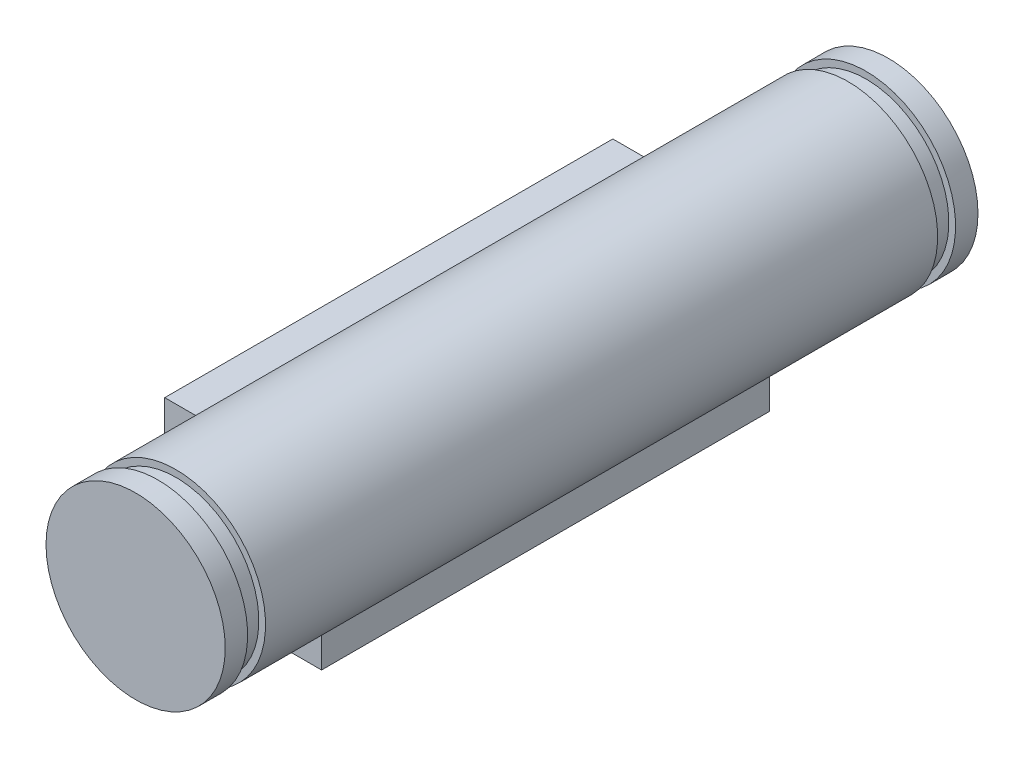
ISO-10303-21;
HEADER;
FILE_DESCRIPTION(('STEP AP214'),'2;1');
FILE_NAME('part.step','',(''),(''),'','','');
FILE_SCHEMA(('AUTOMOTIVE_DESIGN { 1 0 10303 214 1 1 1 1 }'));
ENDSEC;
DATA;
#1=APPLICATION_CONTEXT('core data for automotive mechanical design processes');
#2=APPLICATION_PROTOCOL_DEFINITION('international standard','automotive_design',2000,#1);
#3=PRODUCT_CONTEXT('',#1,'mechanical');
#4=PRODUCT('Part','Part','',(#3));
#5=PRODUCT_RELATED_PRODUCT_CATEGORY('part','',(#4));
#6=PRODUCT_DEFINITION_FORMATION('','',#4);
#7=PRODUCT_DEFINITION_CONTEXT('part definition',#1,'design');
#8=PRODUCT_DEFINITION('design','',#6,#7);
#9=PRODUCT_DEFINITION_SHAPE('','',#8);
#10=(LENGTH_UNIT() NAMED_UNIT(*) SI_UNIT(.MILLI.,.METRE.));
#11=(NAMED_UNIT(*) PLANE_ANGLE_UNIT() SI_UNIT($,.RADIAN.));
#12=(NAMED_UNIT(*) SI_UNIT($,.STERADIAN.) SOLID_ANGLE_UNIT());
#13=UNCERTAINTY_MEASURE_WITH_UNIT(LENGTH_MEASURE(1.E-05),#10,'distance_accuracy_value','');
#14=(GEOMETRIC_REPRESENTATION_CONTEXT(3) GLOBAL_UNCERTAINTY_ASSIGNED_CONTEXT((#13)) GLOBAL_UNIT_ASSIGNED_CONTEXT((#10,
#11,#12)) REPRESENTATION_CONTEXT('',''));
#15=CARTESIAN_POINT('',(0.,0.,0.));
#16=DIRECTION('',(0.,0.,1.));
#17=DIRECTION('',(1.,0.,0.));
#18=AXIS2_PLACEMENT_3D('',#15,#16,#17);
#19=CARTESIAN_POINT('',(0.,0.,16.8));
#20=DIRECTION('',(0.,0.,-1.));
#21=DIRECTION('',(-1.,0.,0.));
#22=AXIS2_PLACEMENT_3D('',#19,#20,#21);
#23=CYLINDRICAL_SURFACE('',#22,4.);
#24=DIRECTION('',(0.,0.,-1.));
#25=VECTOR('',#24,1.);
#26=CARTESIAN_POINT('',(-1.52999999999999,-3.69582196540905,10.));
#27=LINE('',#26,#25);
#28=CARTESIAN_POINT('',(-1.52999999999999,-3.69582196540905,10.));
#29=VERTEX_POINT('',#28);
#30=CARTESIAN_POINT('',(-1.52999999999999,-3.69582196540905,-10.));
#31=VERTEX_POINT('',#30);
#32=EDGE_CURVE('E60',#29,#31,#27,.T.);
#33=ORIENTED_EDGE('',*,*,#32,.F.);
#34=CARTESIAN_POINT('',(0.,0.,10.));
#35=DIRECTION('',(0.,0.,1.));
#36=DIRECTION('',(1.,0.,0.));
#37=AXIS2_PLACEMENT_3D('',#34,#35,#36);
#38=CIRCLE('',#37,4.);
#39=CARTESIAN_POINT('',(1.50000000000001,-3.70809924354783,10.));
#40=VERTEX_POINT('',#39);
#41=EDGE_CURVE('E45',#29,#40,#38,.T.);
#42=ORIENTED_EDGE('',*,*,#41,.T.);
#43=DIRECTION('',(0.,0.,-1.));
#44=VECTOR('',#43,1.);
#45=CARTESIAN_POINT('',(1.50000000000001,-3.70809924354783,10.));
#46=LINE('',#45,#44);
#47=CARTESIAN_POINT('',(1.50000000000001,-3.70809924354783,-10.));
#48=VERTEX_POINT('',#47);
#49=EDGE_CURVE('E172',#40,#48,#46,.T.);
#50=ORIENTED_EDGE('',*,*,#49,.T.);
#51=CARTESIAN_POINT('',(0.,0.,-10.));
#52=DIRECTION('',(0.,0.,1.));
#53=DIRECTION('',(1.,0.,0.));
#54=AXIS2_PLACEMENT_3D('',#51,#52,#53);
#55=CIRCLE('',#54,4.);
#56=EDGE_CURVE('E209',#31,#48,#55,.T.);
#57=ORIENTED_EDGE('',*,*,#56,.F.);
#58=EDGE_LOOP('',(#33,#42,#50,#57));
#59=FACE_BOUND('',#58,.T.);
#60=CARTESIAN_POINT('',(-3.69582196540905,1.53,10.));
#61=VERTEX_POINT('',#60);
#62=CARTESIAN_POINT('',(-3.70809924354783,-1.5,10.));
#63=VERTEX_POINT('',#62);
#64=EDGE_CURVE('E11',#61,#63,#38,.T.);
#65=ORIENTED_EDGE('',*,*,#64,.T.);
#66=DIRECTION('',(0.,0.,-1.));
#67=VECTOR('',#66,1.);
#68=CARTESIAN_POINT('',(-3.70809924354783,-1.5,10.));
#69=LINE('',#68,#67);
#70=CARTESIAN_POINT('',(-3.70809924354783,-1.5,-10.));
#71=VERTEX_POINT('',#70);
#72=EDGE_CURVE('E149',#63,#71,#69,.T.);
#73=ORIENTED_EDGE('',*,*,#72,.T.);
#74=CARTESIAN_POINT('',(-3.69582196540905,1.53,-10.));
#75=VERTEX_POINT('',#74);
#76=EDGE_CURVE('E211',#75,#71,#55,.T.);
#77=ORIENTED_EDGE('',*,*,#76,.F.);
#78=DIRECTION('',(0.,0.,-1.));
#79=VECTOR('',#78,1.);
#80=CARTESIAN_POINT('',(-3.69582196540905,1.53,10.));
#81=LINE('',#80,#79);
#82=EDGE_CURVE('E169',#61,#75,#81,.T.);
#83=ORIENTED_EDGE('',*,*,#82,.F.);
#84=EDGE_LOOP('',(#65,#73,#77,#83));
#85=FACE_BOUND('',#84,.T.);
#86=CARTESIAN_POINT('',(0.,0.,15.));
#87=DIRECTION('',(0.,0.,-1.));
#88=DIRECTION('',(-1.,0.,0.));
#89=AXIS2_PLACEMENT_3D('',#86,#87,#88);
#90=CIRCLE('',#89,4.);
#91=CARTESIAN_POINT('',(-4.,0.,15.));
#92=VERTEX_POINT('',#91);
#93=EDGE_CURVE('E193',#92,#92,#90,.T.);
#94=ORIENTED_EDGE('',*,*,#93,.T.);
#95=EDGE_LOOP('',(#94));
#96=FACE_BOUND('',#95,.T.);
#97=CARTESIAN_POINT('',(0.,0.,-15.));
#98=DIRECTION('',(0.,0.,-1.));
#99=DIRECTION('',(-1.,0.,0.));
#100=AXIS2_PLACEMENT_3D('',#97,#98,#99);
#101=CIRCLE('',#100,4.);
#102=CARTESIAN_POINT('',(-4.,0.,-15.));
#103=VERTEX_POINT('',#102);
#104=EDGE_CURVE('E184',#103,#103,#101,.T.);
#105=ORIENTED_EDGE('',*,*,#104,.F.);
#106=EDGE_LOOP('',(#105));
#107=FACE_BOUND('',#106,.T.);
#108=ADVANCED_FACE('F37',(#59,#85,#96,#107),#23,.T.);
#109=CARTESIAN_POINT('',(0.,4.,15.));
#110=DIRECTION('',(0.,0.,-1.));
#111=DIRECTION('',(-1.,0.,0.));
#112=AXIS2_PLACEMENT_3D('',#109,#110,#111);
#113=PLANE('',#112);
#114=ORIENTED_EDGE('',*,*,#93,.F.);
#115=EDGE_LOOP('',(#114));
#116=FACE_BOUND('',#115,.T.);
#117=CARTESIAN_POINT('',(0.,0.,15.));
#118=DIRECTION('',(0.,0.,-1.));
#119=DIRECTION('',(-1.,0.,0.));
#120=AXIS2_PLACEMENT_3D('',#117,#118,#119);
#121=CIRCLE('',#120,3.7);
#122=CARTESIAN_POINT('',(-3.7,0.,15.));
#123=VERTEX_POINT('',#122);
#124=EDGE_CURVE('E202',#123,#123,#121,.T.);
#125=ORIENTED_EDGE('',*,*,#124,.T.);
#126=EDGE_LOOP('',(#125));
#127=FACE_BOUND('',#126,.T.);
#128=ADVANCED_FACE('F238',(#116,#127),#113,.F.);
#129=CARTESIAN_POINT('',(0.,0.,-18.8));
#130=DIRECTION('',(0.,0.,-1.));
#131=DIRECTION('',(-1.,0.,0.));
#132=AXIS2_PLACEMENT_3D('',#129,#130,#131);
#133=CYLINDRICAL_SURFACE('',#132,3.7);
#134=ORIENTED_EDGE('',*,*,#124,.F.);
#135=EDGE_LOOP('',(#134));
#136=FACE_BOUND('',#135,.T.);
#137=CARTESIAN_POINT('',(0.,0.,15.8));
#138=DIRECTION('',(0.,0.,-1.));
#139=DIRECTION('',(-1.,0.,0.));
#140=AXIS2_PLACEMENT_3D('',#137,#138,#139);
#141=CIRCLE('',#140,3.7);
#142=CARTESIAN_POINT('',(-3.7,0.,15.8));
#143=VERTEX_POINT('',#142);
#144=EDGE_CURVE('E199',#143,#143,#141,.T.);
#145=ORIENTED_EDGE('',*,*,#144,.T.);
#146=EDGE_LOOP('',(#145));
#147=FACE_BOUND('',#146,.T.);
#148=ADVANCED_FACE('F272',(#136,#147),#133,.T.);
#149=CARTESIAN_POINT('',(0.,3.7,15.8));
#150=DIRECTION('',(0.,0.,1.));
#151=DIRECTION('',(1.,0.,0.));
#152=AXIS2_PLACEMENT_3D('',#149,#150,#151);
#153=PLANE('',#152);
#154=ORIENTED_EDGE('',*,*,#144,.F.);
#155=EDGE_LOOP('',(#154));
#156=FACE_BOUND('',#155,.T.);
#157=CARTESIAN_POINT('',(0.,0.,15.8));
#158=DIRECTION('',(0.,0.,-1.));
#159=DIRECTION('',(-1.,0.,0.));
#160=AXIS2_PLACEMENT_3D('',#157,#158,#159);
#161=CIRCLE('',#160,4.);
#162=CARTESIAN_POINT('',(-4.,0.,15.8));
#163=VERTEX_POINT('',#162);
#164=EDGE_CURVE('E196',#163,#163,#161,.T.);
#165=ORIENTED_EDGE('',*,*,#164,.T.);
#166=EDGE_LOOP('',(#165));
#167=FACE_BOUND('',#166,.T.);
#168=ADVANCED_FACE('F268',(#156,#167),#153,.F.);
#169=CARTESIAN_POINT('',(0.,0.,16.8));
#170=DIRECTION('',(0.,0.,1.));
#171=DIRECTION('',(1.,0.,0.));
#172=AXIS2_PLACEMENT_3D('',#169,#170,#171);
#173=PLANE('',#172);
#174=CARTESIAN_POINT('',(0.,0.,16.8));
#175=DIRECTION('',(0.,0.,1.));
#176=DIRECTION('',(1.,0.,0.));
#177=AXIS2_PLACEMENT_3D('',#174,#175,#176);
#178=CIRCLE('',#177,4.);
#179=CARTESIAN_POINT('',(4.,0.,16.8));
#180=VERTEX_POINT('',#179);
#181=EDGE_CURVE('E206',#180,#180,#178,.T.);
#182=ORIENTED_EDGE('',*,*,#181,.T.);
#183=EDGE_LOOP('',(#182));
#184=FACE_BOUND('',#183,.T.);
#185=ADVANCED_FACE('F271',(#184),#173,.T.);
#186=ORIENTED_EDGE('',*,*,#164,.F.);
#187=EDGE_LOOP('',(#186));
#188=FACE_BOUND('',#187,.T.);
#189=ORIENTED_EDGE('',*,*,#181,.F.);
#190=EDGE_LOOP('',(#189));
#191=FACE_BOUND('',#190,.T.);
#192=ADVANCED_FACE('F39',(#188,#191),#23,.T.);
#193=CARTESIAN_POINT('',(0.,0.,-18.8));
#194=DIRECTION('',(0.,0.,-1.));
#195=DIRECTION('',(-1.,0.,0.));
#196=AXIS2_PLACEMENT_3D('',#193,#194,#195);
#197=CYLINDRICAL_SURFACE('',#196,3.7);
#198=CARTESIAN_POINT('',(0.,0.,-15.8));
#199=DIRECTION('',(0.,0.,-1.));
#200=DIRECTION('',(-1.,0.,0.));
#201=AXIS2_PLACEMENT_3D('',#198,#199,#200);
#202=CIRCLE('',#201,3.7);
#203=CARTESIAN_POINT('',(-3.7,0.,-15.8));
#204=VERTEX_POINT('',#203);
#205=EDGE_CURVE('E190',#204,#204,#202,.T.);
#206=ORIENTED_EDGE('',*,*,#205,.F.);
#207=EDGE_LOOP('',(#206));
#208=FACE_BOUND('',#207,.T.);
#209=CARTESIAN_POINT('',(0.,0.,-15.));
#210=DIRECTION('',(0.,0.,-1.));
#211=DIRECTION('',(-1.,0.,0.));
#212=AXIS2_PLACEMENT_3D('',#209,#210,#211);
#213=CIRCLE('',#212,3.7);
#214=CARTESIAN_POINT('',(-3.7,0.,-15.));
#215=VERTEX_POINT('',#214);
#216=EDGE_CURVE('E181',#215,#215,#213,.T.);
#217=ORIENTED_EDGE('',*,*,#216,.T.);
#218=EDGE_LOOP('',(#217));
#219=FACE_BOUND('',#218,.T.);
#220=ADVANCED_FACE('F258',(#208,#219),#197,.T.);
#221=CARTESIAN_POINT('',(0.,3.7,-15.8));
#222=DIRECTION('',(0.,0.,-1.));
#223=DIRECTION('',(-1.,0.,0.));
#224=AXIS2_PLACEMENT_3D('',#221,#222,#223);
#225=PLANE('',#224);
#226=CARTESIAN_POINT('',(0.,0.,-15.8));
#227=DIRECTION('',(0.,0.,-1.));
#228=DIRECTION('',(-1.,0.,0.));
#229=AXIS2_PLACEMENT_3D('',#226,#227,#228);
#230=CIRCLE('',#229,4.);
#231=CARTESIAN_POINT('',(-4.,0.,-15.8));
#232=VERTEX_POINT('',#231);
#233=EDGE_CURVE('E187',#232,#232,#230,.T.);
#234=ORIENTED_EDGE('',*,*,#233,.F.);
#235=EDGE_LOOP('',(#234));
#236=FACE_BOUND('',#235,.T.);
#237=ORIENTED_EDGE('',*,*,#205,.T.);
#238=EDGE_LOOP('',(#237));
#239=FACE_BOUND('',#238,.T.);
#240=ADVANCED_FACE('F249',(#236,#239),#225,.F.);
#241=CARTESIAN_POINT('',(0.,4.,-15.));
#242=DIRECTION('',(0.,0.,1.));
#243=DIRECTION('',(1.,0.,0.));
#244=AXIS2_PLACEMENT_3D('',#241,#242,#243);
#245=PLANE('',#244);
#246=ORIENTED_EDGE('',*,*,#216,.F.);
#247=EDGE_LOOP('',(#246));
#248=FACE_BOUND('',#247,.T.);
#249=ORIENTED_EDGE('',*,*,#104,.T.);
#250=EDGE_LOOP('',(#249));
#251=FACE_BOUND('',#250,.T.);
#252=ADVANCED_FACE('F246',(#248,#251),#245,.F.);
#253=CARTESIAN_POINT('',(0.,0.,-16.8));
#254=DIRECTION('',(0.,0.,1.));
#255=DIRECTION('',(1.,0.,0.));
#256=AXIS2_PLACEMENT_3D('',#253,#254,#255);
#257=PLANE('',#256);
#258=DIRECTION('',(0.,1.,0.));
#259=VECTOR('',#258,1.);
#260=CARTESIAN_POINT('',(-1.,-1.1180339887499,-16.8));
#261=LINE('',#260,#259);
#262=CARTESIAN_POINT('',(-1.,-1.1180339887499,-16.8));
#263=VERTEX_POINT('',#262);
#264=CARTESIAN_POINT('',(-1.,1.1180339887499,-16.8));
#265=VERTEX_POINT('',#264);
#266=EDGE_CURVE('E125',#263,#265,#261,.T.);
#267=ORIENTED_EDGE('',*,*,#266,.F.);
#268=CARTESIAN_POINT('',(0.,0.,-16.8));
#269=DIRECTION('',(0.,0.,-1.));
#270=DIRECTION('',(-1.,0.,0.));
#271=AXIS2_PLACEMENT_3D('',#268,#269,#270);
#272=CIRCLE('',#271,1.5);
#273=EDGE_CURVE('E52',#265,#263,#272,.T.);
#274=ORIENTED_EDGE('',*,*,#273,.F.);
#275=EDGE_LOOP('',(#267,#274));
#276=FACE_BOUND('',#275,.T.);
#277=CARTESIAN_POINT('',(0.,0.,-16.8));
#278=DIRECTION('',(0.,0.,1.));
#279=DIRECTION('',(1.,0.,0.));
#280=AXIS2_PLACEMENT_3D('',#277,#278,#279);
#281=CIRCLE('',#280,4.);
#282=CARTESIAN_POINT('',(4.,0.,-16.8));
#283=VERTEX_POINT('',#282);
#284=EDGE_CURVE('E205',#283,#283,#281,.T.);
#285=ORIENTED_EDGE('',*,*,#284,.F.);
#286=EDGE_LOOP('',(#285));
#287=FACE_BOUND('',#286,.T.);
#288=ADVANCED_FACE('F248',(#276,#287),#257,.F.);
#289=ORIENTED_EDGE('',*,*,#233,.T.);
#290=EDGE_LOOP('',(#289));
#291=FACE_BOUND('',#290,.T.);
#292=ORIENTED_EDGE('',*,*,#284,.T.);
#293=EDGE_LOOP('',(#292));
#294=FACE_BOUND('',#293,.T.);
#295=ADVANCED_FACE('F239',(#291,#294),#23,.T.);
#296=CARTESIAN_POINT('',(-1.52999999999998,-5.50000000000001,10.));
#297=DIRECTION('',(0.,1.,0.));
#298=DIRECTION('',(-1.,0.,0.));
#299=AXIS2_PLACEMENT_3D('',#296,#297,#298);
#300=PLANE('',#299);
#301=DIRECTION('',(1.,0.,0.));
#302=VECTOR('',#301,1.);
#303=CARTESIAN_POINT('',(-1.52999999999998,-5.50000000000001,-10.));
#304=LINE('',#303,#302);
#305=CARTESIAN_POINT('',(-1.52999999999998,-5.50000000000001,-10.));
#306=VERTEX_POINT('',#305);
#307=CARTESIAN_POINT('',(1.50000000000002,-5.5,-10.));
#308=VERTEX_POINT('',#307);
#309=EDGE_CURVE('E151',#306,#308,#304,.T.);
#310=ORIENTED_EDGE('',*,*,#309,.T.);
#311=DIRECTION('',(0.,0.,-1.));
#312=VECTOR('',#311,1.);
#313=CARTESIAN_POINT('',(1.50000000000002,-5.5,10.));
#314=LINE('',#313,#312);
#315=CARTESIAN_POINT('',(1.50000000000002,-5.5,10.));
#316=VERTEX_POINT('',#315);
#317=EDGE_CURVE('E174',#316,#308,#314,.T.);
#318=ORIENTED_EDGE('',*,*,#317,.F.);
#319=DIRECTION('',(1.,0.,0.));
#320=VECTOR('',#319,1.);
#321=CARTESIAN_POINT('',(-1.52999999999998,-5.50000000000001,10.));
#322=LINE('',#321,#320);
#323=CARTESIAN_POINT('',(-1.52999999999998,-5.50000000000001,10.));
#324=VERTEX_POINT('',#323);
#325=EDGE_CURVE('E136',#324,#316,#322,.T.);
#326=ORIENTED_EDGE('',*,*,#325,.F.);
#327=DIRECTION('',(0.,0.,-1.));
#328=VECTOR('',#327,1.);
#329=CARTESIAN_POINT('',(-1.52999999999998,-5.50000000000001,10.));
#330=LINE('',#329,#328);
#331=EDGE_CURVE('E177',#324,#306,#330,.T.);
#332=ORIENTED_EDGE('',*,*,#331,.T.);
#333=EDGE_LOOP('',(#310,#318,#326,#332));
#334=FACE_BOUND('',#333,.T.);
#335=ADVANCED_FACE('F229',(#334),#300,.F.);
#336=CARTESIAN_POINT('',(0.,0.,10.));
#337=DIRECTION('',(0.,0.,1.));
#338=DIRECTION('',(1.,0.,0.));
#339=AXIS2_PLACEMENT_3D('',#336,#337,#338);
#340=PLANE('',#339);
#341=ORIENTED_EDGE('',*,*,#41,.F.);
#342=DIRECTION('',(0.,-1.,0.));
#343=VECTOR('',#342,1.);
#344=CARTESIAN_POINT('',(-1.52999999999999,-3.69582196540905,10.));
#345=LINE('',#344,#343);
#346=EDGE_CURVE('E134',#29,#324,#345,.T.);
#347=ORIENTED_EDGE('',*,*,#346,.T.);
#348=ORIENTED_EDGE('',*,*,#325,.T.);
#349=DIRECTION('',(0.,1.,0.));
#350=VECTOR('',#349,1.);
#351=CARTESIAN_POINT('',(1.50000000000002,-5.5,10.));
#352=LINE('',#351,#350);
#353=EDGE_CURVE('E139',#316,#40,#352,.T.);
#354=ORIENTED_EDGE('',*,*,#353,.T.);
#355=EDGE_LOOP('',(#341,#347,#348,#354));
#356=FACE_BOUND('',#355,.T.);
#357=ADVANCED_FACE('F235',(#356),#340,.T.);
#358=CARTESIAN_POINT('',(0.,0.,-10.));
#359=DIRECTION('',(0.,0.,1.));
#360=DIRECTION('',(1.,0.,0.));
#361=AXIS2_PLACEMENT_3D('',#358,#359,#360);
#362=PLANE('',#361);
#363=DIRECTION('',(0.,-1.,0.));
#364=VECTOR('',#363,1.);
#365=CARTESIAN_POINT('',(-1.52999999999999,-3.69582196540905,-10.));
#366=LINE('',#365,#364);
#367=EDGE_CURVE('E132',#31,#306,#366,.T.);
#368=ORIENTED_EDGE('',*,*,#367,.F.);
#369=ORIENTED_EDGE('',*,*,#56,.T.);
#370=DIRECTION('',(0.,1.,0.));
#371=VECTOR('',#370,1.);
#372=CARTESIAN_POINT('',(1.50000000000002,-5.5,-10.));
#373=LINE('',#372,#371);
#374=EDGE_CURVE('E153',#308,#48,#373,.T.);
#375=ORIENTED_EDGE('',*,*,#374,.F.);
#376=ORIENTED_EDGE('',*,*,#309,.F.);
#377=EDGE_LOOP('',(#368,#369,#375,#376));
#378=FACE_BOUND('',#377,.T.);
#379=ADVANCED_FACE('F220',(#378),#362,.F.);
#380=CARTESIAN_POINT('',(1.50000000000002,-5.5,10.));
#381=DIRECTION('',(-1.,0.,0.));
#382=DIRECTION('',(0.,-1.,0.));
#383=AXIS2_PLACEMENT_3D('',#380,#381,#382);
#384=PLANE('',#383);
#385=ORIENTED_EDGE('',*,*,#374,.T.);
#386=ORIENTED_EDGE('',*,*,#49,.F.);
#387=ORIENTED_EDGE('',*,*,#353,.F.);
#388=ORIENTED_EDGE('',*,*,#317,.T.);
#389=EDGE_LOOP('',(#385,#386,#387,#388));
#390=FACE_BOUND('',#389,.T.);
#391=ADVANCED_FACE('F224',(#390),#384,.F.);
#392=CARTESIAN_POINT('',(-1.52999999999999,-3.69582196540905,10.));
#393=DIRECTION('',(1.,0.,0.));
#394=DIRECTION('',(0.,1.,0.));
#395=AXIS2_PLACEMENT_3D('',#392,#393,#394);
#396=PLANE('',#395);
#397=ORIENTED_EDGE('',*,*,#367,.T.);
#398=ORIENTED_EDGE('',*,*,#331,.F.);
#399=ORIENTED_EDGE('',*,*,#346,.F.);
#400=ORIENTED_EDGE('',*,*,#32,.T.);
#401=EDGE_LOOP('',(#397,#398,#399,#400));
#402=FACE_BOUND('',#401,.T.);
#403=ADVANCED_FACE('F233',(#402),#396,.F.);
#404=ORIENTED_EDGE('',*,*,#64,.F.);
#405=DIRECTION('',(-1.,0.,0.));
#406=VECTOR('',#405,1.);
#407=CARTESIAN_POINT('',(-3.69582196540905,1.53,10.));
#408=LINE('',#407,#406);
#409=CARTESIAN_POINT('',(-5.5,1.53,10.));
#410=VERTEX_POINT('',#409);
#411=EDGE_CURVE('E142',#61,#410,#408,.T.);
#412=ORIENTED_EDGE('',*,*,#411,.T.);
#413=DIRECTION('',(0.,-1.,0.));
#414=VECTOR('',#413,1.);
#415=CARTESIAN_POINT('',(-5.5,1.53,10.));
#416=LINE('',#415,#414);
#417=CARTESIAN_POINT('',(-5.5,-1.5,10.));
#418=VERTEX_POINT('',#417);
#419=EDGE_CURVE('E144',#410,#418,#416,.T.);
#420=ORIENTED_EDGE('',*,*,#419,.T.);
#421=DIRECTION('',(1.,0.,0.));
#422=VECTOR('',#421,1.);
#423=CARTESIAN_POINT('',(-5.5,-1.5,10.));
#424=LINE('',#423,#422);
#425=EDGE_CURVE('E146',#418,#63,#424,.T.);
#426=ORIENTED_EDGE('',*,*,#425,.T.);
#427=EDGE_LOOP('',(#404,#412,#420,#426));
#428=FACE_BOUND('',#427,.T.);
#429=ADVANCED_FACE('F307',(#428),#340,.T.);
#430=DIRECTION('',(-1.,0.,0.));
#431=VECTOR('',#430,1.);
#432=CARTESIAN_POINT('',(-3.69582196540905,1.53,-10.));
#433=LINE('',#432,#431);
#434=CARTESIAN_POINT('',(-5.5,1.53,-10.));
#435=VERTEX_POINT('',#434);
#436=EDGE_CURVE('E156',#75,#435,#433,.T.);
#437=ORIENTED_EDGE('',*,*,#436,.F.);
#438=ORIENTED_EDGE('',*,*,#76,.T.);
#439=DIRECTION('',(1.,0.,0.));
#440=VECTOR('',#439,1.);
#441=CARTESIAN_POINT('',(-5.5,-1.5,-10.));
#442=LINE('',#441,#440);
#443=CARTESIAN_POINT('',(-5.5,-1.5,-10.));
#444=VERTEX_POINT('',#443);
#445=EDGE_CURVE('E137',#444,#71,#442,.T.);
#446=ORIENTED_EDGE('',*,*,#445,.F.);
#447=DIRECTION('',(0.,-1.,0.));
#448=VECTOR('',#447,1.);
#449=CARTESIAN_POINT('',(-5.5,1.53,-10.));
#450=LINE('',#449,#448);
#451=EDGE_CURVE('E158',#435,#444,#450,.T.);
#452=ORIENTED_EDGE('',*,*,#451,.F.);
#453=EDGE_LOOP('',(#437,#438,#446,#452));
#454=FACE_BOUND('',#453,.T.);
#455=ADVANCED_FACE('F315',(#454),#362,.F.);
#456=CARTESIAN_POINT('',(-3.69582196540905,1.53,10.));
#457=DIRECTION('',(0.,-1.,0.));
#458=DIRECTION('',(1.,0.,0.));
#459=AXIS2_PLACEMENT_3D('',#456,#457,#458);
#460=PLANE('',#459);
#461=ORIENTED_EDGE('',*,*,#436,.T.);
#462=DIRECTION('',(0.,0.,-1.));
#463=VECTOR('',#462,1.);
#464=CARTESIAN_POINT('',(-5.5,1.53,10.));
#465=LINE('',#464,#463);
#466=EDGE_CURVE('E166',#410,#435,#465,.T.);
#467=ORIENTED_EDGE('',*,*,#466,.F.);
#468=ORIENTED_EDGE('',*,*,#411,.F.);
#469=ORIENTED_EDGE('',*,*,#82,.T.);
#470=EDGE_LOOP('',(#461,#467,#468,#469));
#471=FACE_BOUND('',#470,.T.);
#472=ADVANCED_FACE('F311',(#471),#460,.F.);
#473=CARTESIAN_POINT('',(-5.5,1.53,10.));
#474=DIRECTION('',(1.,0.,0.));
#475=DIRECTION('',(0.,0.,-1.));
#476=AXIS2_PLACEMENT_3D('',#473,#474,#475);
#477=PLANE('',#476);
#478=ORIENTED_EDGE('',*,*,#451,.T.);
#479=DIRECTION('',(0.,0.,-1.));
#480=VECTOR('',#479,1.);
#481=CARTESIAN_POINT('',(-5.5,-1.5,10.));
#482=LINE('',#481,#480);
#483=EDGE_CURVE('E163',#418,#444,#482,.T.);
#484=ORIENTED_EDGE('',*,*,#483,.F.);
#485=ORIENTED_EDGE('',*,*,#419,.F.);
#486=ORIENTED_EDGE('',*,*,#466,.T.);
#487=EDGE_LOOP('',(#478,#484,#485,#486));
#488=FACE_BOUND('',#487,.T.);
#489=ADVANCED_FACE('F314',(#488),#477,.F.);
#490=CARTESIAN_POINT('',(-5.5,-1.5,10.));
#491=DIRECTION('',(0.,1.,0.));
#492=DIRECTION('',(0.,0.,1.));
#493=AXIS2_PLACEMENT_3D('',#490,#491,#492);
#494=PLANE('',#493);
#495=ORIENTED_EDGE('',*,*,#445,.T.);
#496=ORIENTED_EDGE('',*,*,#72,.F.);
#497=ORIENTED_EDGE('',*,*,#425,.F.);
#498=ORIENTED_EDGE('',*,*,#483,.T.);
#499=EDGE_LOOP('',(#495,#496,#497,#498));
#500=FACE_BOUND('',#499,.T.);
#501=ADVANCED_FACE('F319',(#500),#494,.F.);
#502=CARTESIAN_POINT('',(0.,0.,3.2));
#503=DIRECTION('',(0.,0.,-1.));
#504=DIRECTION('',(-1.,0.,0.));
#505=AXIS2_PLACEMENT_3D('',#502,#503,#504);
#506=CYLINDRICAL_SURFACE('',#505,1.5);
#507=ORIENTED_EDGE('',*,*,#273,.T.);
#508=DIRECTION('',(0.,0.,-1.));
#509=VECTOR('',#508,1.);
#510=CARTESIAN_POINT('',(-1.,-1.1180339887499,3.2));
#511=LINE('',#510,#509);
#512=CARTESIAN_POINT('',(-1.,-1.1180339887499,3.2));
#513=VERTEX_POINT('',#512);
#514=EDGE_CURVE('E111',#513,#263,#511,.T.);
#515=ORIENTED_EDGE('',*,*,#514,.F.);
#516=CARTESIAN_POINT('',(0.,0.,3.2));
#517=DIRECTION('',(0.,0.,-1.));
#518=DIRECTION('',(-1.,0.,0.));
#519=AXIS2_PLACEMENT_3D('',#516,#517,#518);
#520=CIRCLE('',#519,1.5);
#521=CARTESIAN_POINT('',(-1.,1.1180339887499,3.2));
#522=VERTEX_POINT('',#521);
#523=EDGE_CURVE('E114',#522,#513,#520,.T.);
#524=ORIENTED_EDGE('',*,*,#523,.F.);
#525=DIRECTION('',(0.,0.,-1.));
#526=VECTOR('',#525,1.);
#527=CARTESIAN_POINT('',(-1.,1.1180339887499,3.2));
#528=LINE('',#527,#526);
#529=EDGE_CURVE('E120',#522,#265,#528,.T.);
#530=ORIENTED_EDGE('',*,*,#529,.T.);
#531=EDGE_LOOP('',(#507,#515,#524,#530));
#532=FACE_BOUND('',#531,.T.);
#533=ADVANCED_FACE('F113',(#532),#506,.F.);
#534=CARTESIAN_POINT('',(-1.,-1.1180339887499,3.2));
#535=DIRECTION('',(-1.,0.,0.));
#536=DIRECTION('',(0.,0.,1.));
#537=AXIS2_PLACEMENT_3D('',#534,#535,#536);
#538=PLANE('',#537);
#539=ORIENTED_EDGE('',*,*,#266,.T.);
#540=ORIENTED_EDGE('',*,*,#529,.F.);
#541=DIRECTION('',(0.,1.,0.));
#542=VECTOR('',#541,1.);
#543=CARTESIAN_POINT('',(-1.,-1.1180339887499,3.2));
#544=LINE('',#543,#542);
#545=EDGE_CURVE('E121',#513,#522,#544,.T.);
#546=ORIENTED_EDGE('',*,*,#545,.F.);
#547=ORIENTED_EDGE('',*,*,#514,.T.);
#548=EDGE_LOOP('',(#539,#540,#546,#547));
#549=FACE_BOUND('',#548,.T.);
#550=ADVANCED_FACE('F127',(#549),#538,.F.);
#551=CARTESIAN_POINT('',(0.,0.,3.2));
#552=DIRECTION('',(0.,0.,-1.));
#553=DIRECTION('',(-1.,0.,0.));
#554=AXIS2_PLACEMENT_3D('',#551,#552,#553);
#555=PLANE('',#554);
#556=ORIENTED_EDGE('',*,*,#523,.T.);
#557=ORIENTED_EDGE('',*,*,#545,.T.);
#558=EDGE_LOOP('',(#556,#557));
#559=FACE_BOUND('',#558,.T.);
#560=ADVANCED_FACE('F124',(#559),#555,.T.);
#561=CLOSED_SHELL('',(#108,#128,#148,#168,#185,#192,#220,#240,#252,#288,#295,#335,#357,#379,
#391,#403,#429,#455,#472,#489,#501,#533,#550,#560));
#562=MANIFOLD_SOLID_BREP('B2',#561);
#563=ADVANCED_BREP_SHAPE_REPRESENTATION('',(#18,#562),#14);
#564=SHAPE_DEFINITION_REPRESENTATION(#9,#563);
ENDSEC;
END-ISO-10303-21;
